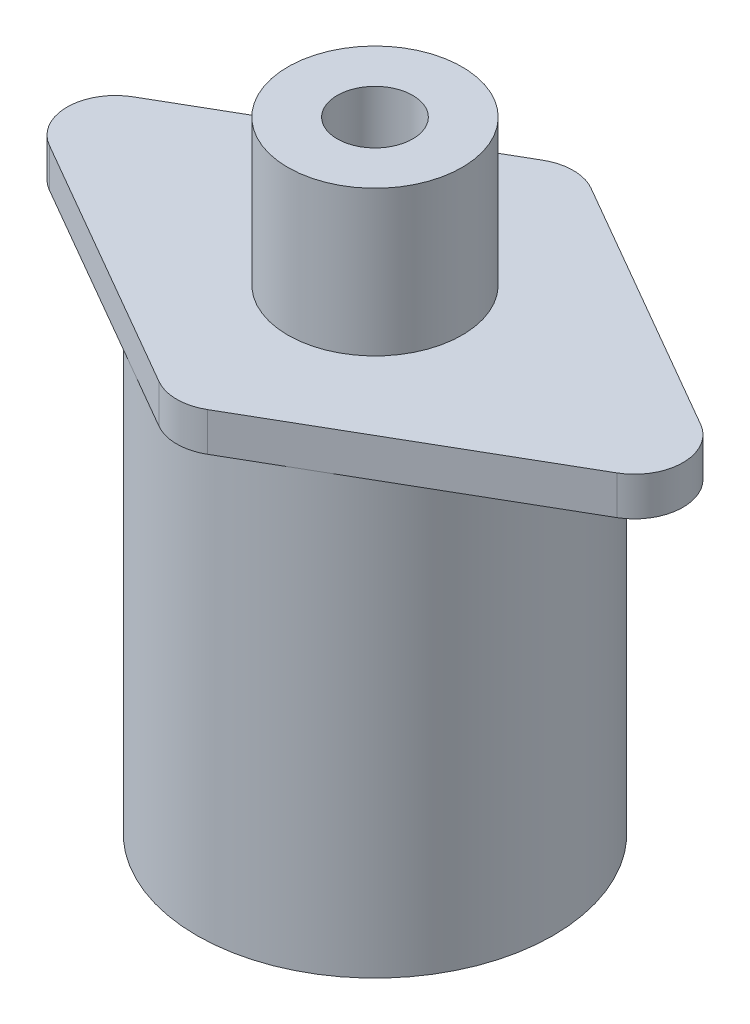
ISO-10303-21;
HEADER;
FILE_DESCRIPTION(('STEP AP214'),'2;1');
FILE_NAME('part.step','',(''),(''),'','','');
FILE_SCHEMA(('AUTOMOTIVE_DESIGN { 1 0 10303 214 1 1 1 1 }'));
ENDSEC;
DATA;
#1=APPLICATION_CONTEXT('core data for automotive mechanical design processes');
#2=APPLICATION_PROTOCOL_DEFINITION('international standard','automotive_design',2000,#1);
#3=PRODUCT_CONTEXT('',#1,'mechanical');
#4=PRODUCT('Part','Part','',(#3));
#5=PRODUCT_RELATED_PRODUCT_CATEGORY('part','',(#4));
#6=PRODUCT_DEFINITION_FORMATION('','',#4);
#7=PRODUCT_DEFINITION_CONTEXT('part definition',#1,'design');
#8=PRODUCT_DEFINITION('design','',#6,#7);
#9=PRODUCT_DEFINITION_SHAPE('','',#8);
#10=(LENGTH_UNIT() NAMED_UNIT(*) SI_UNIT(.MILLI.,.METRE.));
#11=(NAMED_UNIT(*) PLANE_ANGLE_UNIT() SI_UNIT($,.RADIAN.));
#12=(NAMED_UNIT(*) SI_UNIT($,.STERADIAN.) SOLID_ANGLE_UNIT());
#13=UNCERTAINTY_MEASURE_WITH_UNIT(LENGTH_MEASURE(1.E-05),#10,'distance_accuracy_value','');
#14=(GEOMETRIC_REPRESENTATION_CONTEXT(3) GLOBAL_UNCERTAINTY_ASSIGNED_CONTEXT((#13)) GLOBAL_UNIT_ASSIGNED_CONTEXT((#10,
#11,#12)) REPRESENTATION_CONTEXT('',''));
#15=CARTESIAN_POINT('',(0.,0.,0.));
#16=DIRECTION('',(0.,0.,1.));
#17=DIRECTION('',(1.,0.,0.));
#18=AXIS2_PLACEMENT_3D('',#15,#16,#17);
#19=CARTESIAN_POINT('',(0.,45.,0.));
#20=DIRECTION('',(0.,-1.,0.));
#21=DIRECTION('',(0.,0.,-1.));
#22=AXIS2_PLACEMENT_3D('',#19,#20,#21);
#23=CYLINDRICAL_SURFACE('',#22,18.4);
#24=CARTESIAN_POINT('',(0.,45.,0.));
#25=DIRECTION('',(0.,1.,0.));
#26=DIRECTION('',(0.,0.,1.));
#27=AXIS2_PLACEMENT_3D('',#24,#25,#26);
#28=CIRCLE('',#27,18.4);
#29=CARTESIAN_POINT('',(0.,45.,18.4));
#30=VERTEX_POINT('',#29);
#31=EDGE_CURVE('E148',#30,#30,#28,.T.);
#32=ORIENTED_EDGE('',*,*,#31,.F.);
#33=EDGE_LOOP('',(#32));
#34=FACE_BOUND('',#33,.T.);
#35=CARTESIAN_POINT('',(0.,0.,0.));
#36=DIRECTION('',(0.,1.,0.));
#37=DIRECTION('',(0.,0.,1.));
#38=AXIS2_PLACEMENT_3D('',#35,#36,#37);
#39=CIRCLE('',#38,18.4);
#40=CARTESIAN_POINT('',(0.,0.,18.4));
#41=VERTEX_POINT('',#40);
#42=EDGE_CURVE('E151',#41,#41,#39,.T.);
#43=ORIENTED_EDGE('',*,*,#42,.T.);
#44=EDGE_LOOP('',(#43));
#45=FACE_BOUND('',#44,.T.);
#46=ADVANCED_FACE('F42',(#34,#45),#23,.T.);
#47=CARTESIAN_POINT('',(0.,0.,0.));
#48=DIRECTION('',(0.,1.,0.));
#49=DIRECTION('',(0.,0.,1.));
#50=AXIS2_PLACEMENT_3D('',#47,#48,#49);
#51=PLANE('',#50);
#52=ORIENTED_EDGE('',*,*,#42,.F.);
#53=EDGE_LOOP('',(#52));
#54=FACE_BOUND('',#53,.T.);
#55=ADVANCED_FACE('F239',(#54),#51,.F.);
#56=CARTESIAN_POINT('',(36.8060796608387,49.,0.));
#57=DIRECTION('',(-0.5,0.,0.866025403784439));
#58=DIRECTION('',(0.866025403784439,0.,0.5));
#59=AXIS2_PLACEMENT_3D('',#56,#57,#58);
#60=PLANE('',#59);
#61=DIRECTION('',(-0.866025403784439,0.,-0.5));
#62=VECTOR('',#61,1.);
#63=CARTESIAN_POINT('',(36.8060796608387,45.,0.));
#64=LINE('',#63,#62);
#65=CARTESIAN_POINT('',(29.3060796608386,45.,-4.3301270189222));
#66=VERTEX_POINT('',#65);
#67=CARTESIAN_POINT('',(2.50000000000001,45.,-19.8066243270259));
#68=VERTEX_POINT('',#67);
#69=EDGE_CURVE('E137',#66,#68,#64,.T.);
#70=ORIENTED_EDGE('',*,*,#69,.T.);
#71=DIRECTION('',(0.,-1.,0.));
#72=VECTOR('',#71,1.);
#73=CARTESIAN_POINT('',(2.5,49.,-19.8066243270259));
#74=LINE('',#73,#72);
#75=CARTESIAN_POINT('',(2.50000000000001,49.,-19.8066243270259));
#76=VERTEX_POINT('',#75);
#77=EDGE_CURVE('E115',#68,#76,#74,.F.);
#78=ORIENTED_EDGE('',*,*,#77,.T.);
#79=DIRECTION('',(-0.866025403784439,0.,-0.5));
#80=VECTOR('',#79,1.);
#81=CARTESIAN_POINT('',(36.8060796608387,49.,0.));
#82=LINE('',#81,#80);
#83=CARTESIAN_POINT('',(29.3060796608386,49.,-4.3301270189222));
#84=VERTEX_POINT('',#83);
#85=EDGE_CURVE('E147',#84,#76,#82,.T.);
#86=ORIENTED_EDGE('',*,*,#85,.F.);
#87=DIRECTION('',(0.,-1.,0.));
#88=VECTOR('',#87,1.);
#89=CARTESIAN_POINT('',(29.3060796608386,49.,-4.3301270189222));
#90=LINE('',#89,#88);
#91=EDGE_CURVE('E120',#84,#66,#90,.T.);
#92=ORIENTED_EDGE('',*,*,#91,.T.);
#93=EDGE_LOOP('',(#70,#78,#86,#92));
#94=FACE_BOUND('',#93,.T.);
#95=ADVANCED_FACE('F196',(#94),#60,.F.);
#96=CARTESIAN_POINT('',(0.,49.,-21.25));
#97=DIRECTION('',(0.5,0.,0.866025403784439));
#98=DIRECTION('',(0.866025403784439,0.,-0.5));
#99=AXIS2_PLACEMENT_3D('',#96,#97,#98);
#100=PLANE('',#99);
#101=DIRECTION('',(-0.866025403784439,0.,0.5));
#102=VECTOR('',#101,1.);
#103=CARTESIAN_POINT('',(0.,49.,-21.25));
#104=LINE('',#103,#102);
#105=CARTESIAN_POINT('',(-2.5,49.,-19.8066243270259));
#106=VERTEX_POINT('',#105);
#107=CARTESIAN_POINT('',(-29.3060796608386,49.,-4.3301270189222));
#108=VERTEX_POINT('',#107);
#109=EDGE_CURVE('E130',#106,#108,#104,.T.);
#110=ORIENTED_EDGE('',*,*,#109,.F.);
#111=DIRECTION('',(0.,-1.,0.));
#112=VECTOR('',#111,1.);
#113=CARTESIAN_POINT('',(-2.5,49.,-19.8066243270259));
#114=LINE('',#113,#112);
#115=CARTESIAN_POINT('',(-2.5,45.,-19.8066243270259));
#116=VERTEX_POINT('',#115);
#117=EDGE_CURVE('E114',#106,#116,#114,.T.);
#118=ORIENTED_EDGE('',*,*,#117,.T.);
#119=DIRECTION('',(-0.866025403784439,0.,0.5));
#120=VECTOR('',#119,1.);
#121=CARTESIAN_POINT('',(0.,45.,-21.25));
#122=LINE('',#121,#120);
#123=CARTESIAN_POINT('',(-29.3060796608386,45.,-4.3301270189222));
#124=VERTEX_POINT('',#123);
#125=EDGE_CURVE('E127',#116,#124,#122,.T.);
#126=ORIENTED_EDGE('',*,*,#125,.T.);
#127=DIRECTION('',(0.,-1.,0.));
#128=VECTOR('',#127,1.);
#129=CARTESIAN_POINT('',(-29.3060796608386,49.,-4.3301270189222));
#130=LINE('',#129,#128);
#131=EDGE_CURVE('E132',#124,#108,#130,.F.);
#132=ORIENTED_EDGE('',*,*,#131,.T.);
#133=EDGE_LOOP('',(#110,#118,#126,#132));
#134=FACE_BOUND('',#133,.T.);
#135=ADVANCED_FACE('F126',(#134),#100,.F.);
#136=CARTESIAN_POINT('',(-36.8060796608386,49.,0.));
#137=DIRECTION('',(0.5,0.,-0.866025403784439));
#138=DIRECTION('',(-0.866025403784439,0.,-0.5));
#139=AXIS2_PLACEMENT_3D('',#136,#137,#138);
#140=PLANE('',#139);
#141=DIRECTION('',(0.866025403784439,0.,0.5));
#142=VECTOR('',#141,1.);
#143=CARTESIAN_POINT('',(-36.8060796608386,45.,0.));
#144=LINE('',#143,#142);
#145=CARTESIAN_POINT('',(-29.3060796608386,45.,4.33012701892218));
#146=VERTEX_POINT('',#145);
#147=CARTESIAN_POINT('',(-2.5,45.,19.8066243270259));
#148=VERTEX_POINT('',#147);
#149=EDGE_CURVE('E136',#146,#148,#144,.T.);
#150=ORIENTED_EDGE('',*,*,#149,.T.);
#151=DIRECTION('',(0.,-1.,0.));
#152=VECTOR('',#151,1.);
#153=CARTESIAN_POINT('',(-2.5,49.,19.8066243270259));
#154=LINE('',#153,#152);
#155=CARTESIAN_POINT('',(-2.5,49.,19.8066243270259));
#156=VERTEX_POINT('',#155);
#157=EDGE_CURVE('E46',#148,#156,#154,.F.);
#158=ORIENTED_EDGE('',*,*,#157,.T.);
#159=DIRECTION('',(0.866025403784439,0.,0.5));
#160=VECTOR('',#159,1.);
#161=CARTESIAN_POINT('',(-36.8060796608386,49.,0.));
#162=LINE('',#161,#160);
#163=CARTESIAN_POINT('',(-29.3060796608386,49.,4.33012701892218));
#164=VERTEX_POINT('',#163);
#165=EDGE_CURVE('E180',#164,#156,#162,.T.);
#166=ORIENTED_EDGE('',*,*,#165,.F.);
#167=DIRECTION('',(0.,-1.,0.));
#168=VECTOR('',#167,1.);
#169=CARTESIAN_POINT('',(-29.3060796608386,49.,4.33012701892218));
#170=LINE('',#169,#168);
#171=EDGE_CURVE('E173',#164,#146,#170,.T.);
#172=ORIENTED_EDGE('',*,*,#171,.T.);
#173=EDGE_LOOP('',(#150,#158,#166,#172));
#174=FACE_BOUND('',#173,.T.);
#175=ADVANCED_FACE('F179',(#174),#140,.F.);
#176=CARTESIAN_POINT('',(0.,49.,21.25));
#177=DIRECTION('',(-0.5,0.,-0.866025403784439));
#178=DIRECTION('',(-0.866025403784439,0.,0.5));
#179=AXIS2_PLACEMENT_3D('',#176,#177,#178);
#180=PLANE('',#179);
#181=DIRECTION('',(0.866025403784439,0.,-0.5));
#182=VECTOR('',#181,1.);
#183=CARTESIAN_POINT('',(0.,49.,21.25));
#184=LINE('',#183,#182);
#185=CARTESIAN_POINT('',(2.5,49.,19.8066243270259));
#186=VERTEX_POINT('',#185);
#187=CARTESIAN_POINT('',(29.3060796608386,49.,4.33012701892219));
#188=VERTEX_POINT('',#187);
#189=EDGE_CURVE('E154',#186,#188,#184,.T.);
#190=ORIENTED_EDGE('',*,*,#189,.F.);
#191=DIRECTION('',(0.,-1.,0.));
#192=VECTOR('',#191,1.);
#193=CARTESIAN_POINT('',(2.5,49.,19.8066243270259));
#194=LINE('',#193,#192);
#195=CARTESIAN_POINT('',(2.5,45.,19.8066243270259));
#196=VERTEX_POINT('',#195);
#197=EDGE_CURVE('E171',#186,#196,#194,.T.);
#198=ORIENTED_EDGE('',*,*,#197,.T.);
#199=DIRECTION('',(0.866025403784439,0.,-0.5));
#200=VECTOR('',#199,1.);
#201=CARTESIAN_POINT('',(0.,45.,21.25));
#202=LINE('',#201,#200);
#203=CARTESIAN_POINT('',(29.3060796608386,45.,4.33012701892219));
#204=VERTEX_POINT('',#203);
#205=EDGE_CURVE('E140',#196,#204,#202,.T.);
#206=ORIENTED_EDGE('',*,*,#205,.T.);
#207=DIRECTION('',(0.,-1.,0.));
#208=VECTOR('',#207,1.);
#209=CARTESIAN_POINT('',(29.3060796608386,49.,4.33012701892219));
#210=LINE('',#209,#208);
#211=EDGE_CURVE('E58',#204,#188,#210,.F.);
#212=ORIENTED_EDGE('',*,*,#211,.T.);
#213=EDGE_LOOP('',(#190,#198,#206,#212));
#214=FACE_BOUND('',#213,.T.);
#215=ADVANCED_FACE('F189',(#214),#180,.F.);
#216=CARTESIAN_POINT('',(0.,49.,0.));
#217=DIRECTION('',(0.,1.,0.));
#218=DIRECTION('',(0.,0.,1.));
#219=AXIS2_PLACEMENT_3D('',#216,#217,#218);
#220=PLANE('',#219);
#221=CARTESIAN_POINT('',(0.,49.,0.));
#222=DIRECTION('',(0.,1.,0.));
#223=DIRECTION('',(0.,0.,1.));
#224=AXIS2_PLACEMENT_3D('',#221,#222,#223);
#225=CIRCLE('',#224,9.);
#226=CARTESIAN_POINT('',(0.,49.,9.));
#227=VERTEX_POINT('',#226);
#228=EDGE_CURVE('E11',#227,#227,#225,.T.);
#229=ORIENTED_EDGE('',*,*,#228,.F.);
#230=EDGE_LOOP('',(#229));
#231=FACE_BOUND('',#230,.T.);
#232=ORIENTED_EDGE('',*,*,#85,.T.);
#233=CARTESIAN_POINT('',(0.,49.,-15.4764973081037));
#234=DIRECTION('',(0.,1.,0.));
#235=DIRECTION('',(0.,0.,1.));
#236=AXIS2_PLACEMENT_3D('',#233,#234,#235);
#237=CIRCLE('',#236,5.);
#238=EDGE_CURVE('E168',#76,#106,#237,.T.);
#239=ORIENTED_EDGE('',*,*,#238,.T.);
#240=ORIENTED_EDGE('',*,*,#109,.T.);
#241=CARTESIAN_POINT('',(-26.8060796608386,49.,0.));
#242=DIRECTION('',(0.,1.,0.));
#243=DIRECTION('',(0.,0.,1.));
#244=AXIS2_PLACEMENT_3D('',#241,#242,#243);
#245=CIRCLE('',#244,5.);
#246=EDGE_CURVE('E163',#108,#164,#245,.T.);
#247=ORIENTED_EDGE('',*,*,#246,.T.);
#248=ORIENTED_EDGE('',*,*,#165,.T.);
#249=CARTESIAN_POINT('',(0.,49.,15.4764973081037));
#250=DIRECTION('',(0.,1.,0.));
#251=DIRECTION('',(0.,0.,1.));
#252=AXIS2_PLACEMENT_3D('',#249,#250,#251);
#253=CIRCLE('',#252,5.);
#254=EDGE_CURVE('E65',#156,#186,#253,.T.);
#255=ORIENTED_EDGE('',*,*,#254,.T.);
#256=ORIENTED_EDGE('',*,*,#189,.T.);
#257=CARTESIAN_POINT('',(26.8060796608386,49.,0.));
#258=DIRECTION('',(0.,1.,0.));
#259=DIRECTION('',(0.,0.,1.));
#260=AXIS2_PLACEMENT_3D('',#257,#258,#259);
#261=CIRCLE('',#260,5.);
#262=EDGE_CURVE('E165',#188,#84,#261,.T.);
#263=ORIENTED_EDGE('',*,*,#262,.T.);
#264=EDGE_LOOP('',(#232,#239,#240,#247,#248,#255,#256,#263));
#265=FACE_BOUND('',#264,.T.);
#266=ADVANCED_FACE('F183',(#231,#265),#220,.T.);
#267=CARTESIAN_POINT('',(0.,45.,0.));
#268=DIRECTION('',(0.,1.,0.));
#269=DIRECTION('',(0.,0.,1.));
#270=AXIS2_PLACEMENT_3D('',#267,#268,#269);
#271=PLANE('',#270);
#272=ORIENTED_EDGE('',*,*,#31,.T.);
#273=EDGE_LOOP('',(#272));
#274=FACE_BOUND('',#273,.T.);
#275=ORIENTED_EDGE('',*,*,#125,.F.);
#276=CARTESIAN_POINT('',(0.,45.,-15.4764973081037));
#277=DIRECTION('',(0.,1.,0.));
#278=DIRECTION('',(0.,0.,1.));
#279=AXIS2_PLACEMENT_3D('',#276,#277,#278);
#280=CIRCLE('',#279,5.);
#281=EDGE_CURVE('E110',#116,#68,#280,.F.);
#282=ORIENTED_EDGE('',*,*,#281,.T.);
#283=ORIENTED_EDGE('',*,*,#69,.F.);
#284=CARTESIAN_POINT('',(26.8060796608386,45.,0.));
#285=DIRECTION('',(0.,1.,0.));
#286=DIRECTION('',(0.,0.,1.));
#287=AXIS2_PLACEMENT_3D('',#284,#285,#286);
#288=CIRCLE('',#287,5.);
#289=EDGE_CURVE('E157',#66,#204,#288,.F.);
#290=ORIENTED_EDGE('',*,*,#289,.T.);
#291=ORIENTED_EDGE('',*,*,#205,.F.);
#292=CARTESIAN_POINT('',(0.,45.,15.4764973081037));
#293=DIRECTION('',(0.,1.,0.));
#294=DIRECTION('',(0.,0.,1.));
#295=AXIS2_PLACEMENT_3D('',#292,#293,#294);
#296=CIRCLE('',#295,5.);
#297=EDGE_CURVE('E121',#196,#148,#296,.F.);
#298=ORIENTED_EDGE('',*,*,#297,.T.);
#299=ORIENTED_EDGE('',*,*,#149,.F.);
#300=CARTESIAN_POINT('',(-26.8060796608386,45.,0.));
#301=DIRECTION('',(0.,1.,0.));
#302=DIRECTION('',(0.,0.,1.));
#303=AXIS2_PLACEMENT_3D('',#300,#301,#302);
#304=CIRCLE('',#303,5.);
#305=EDGE_CURVE('E131',#146,#124,#304,.F.);
#306=ORIENTED_EDGE('',*,*,#305,.T.);
#307=EDGE_LOOP('',(#275,#282,#283,#290,#291,#298,#299,#306));
#308=FACE_BOUND('',#307,.T.);
#309=ADVANCED_FACE('F134',(#274,#308),#271,.F.);
#310=CARTESIAN_POINT('',(0.,49.,-15.4764973081037));
#311=DIRECTION('',(0.,-1.,0.));
#312=DIRECTION('',(0.,0.,-1.));
#313=AXIS2_PLACEMENT_3D('',#310,#311,#312);
#314=CYLINDRICAL_SURFACE('',#313,5.);
#315=ORIENTED_EDGE('',*,*,#238,.F.);
#316=ORIENTED_EDGE('',*,*,#77,.F.);
#317=ORIENTED_EDGE('',*,*,#281,.F.);
#318=ORIENTED_EDGE('',*,*,#117,.F.);
#319=EDGE_LOOP('',(#315,#316,#317,#318));
#320=FACE_BOUND('',#319,.T.);
#321=ADVANCED_FACE('F113',(#320),#314,.T.);
#322=CARTESIAN_POINT('',(0.,49.,15.4764973081037));
#323=DIRECTION('',(0.,-1.,0.));
#324=DIRECTION('',(0.,0.,-1.));
#325=AXIS2_PLACEMENT_3D('',#322,#323,#324);
#326=CYLINDRICAL_SURFACE('',#325,5.);
#327=ORIENTED_EDGE('',*,*,#254,.F.);
#328=ORIENTED_EDGE('',*,*,#157,.F.);
#329=ORIENTED_EDGE('',*,*,#297,.F.);
#330=ORIENTED_EDGE('',*,*,#197,.F.);
#331=EDGE_LOOP('',(#327,#328,#329,#330));
#332=FACE_BOUND('',#331,.T.);
#333=ADVANCED_FACE('F187',(#332),#326,.T.);
#334=CARTESIAN_POINT('',(26.8060796608386,49.,0.));
#335=DIRECTION('',(0.,-1.,0.));
#336=DIRECTION('',(0.,0.,-1.));
#337=AXIS2_PLACEMENT_3D('',#334,#335,#336);
#338=CYLINDRICAL_SURFACE('',#337,5.);
#339=ORIENTED_EDGE('',*,*,#262,.F.);
#340=ORIENTED_EDGE('',*,*,#211,.F.);
#341=ORIENTED_EDGE('',*,*,#289,.F.);
#342=ORIENTED_EDGE('',*,*,#91,.F.);
#343=EDGE_LOOP('',(#339,#340,#341,#342));
#344=FACE_BOUND('',#343,.T.);
#345=ADVANCED_FACE('F193',(#344),#338,.T.);
#346=CARTESIAN_POINT('',(-26.8060796608386,49.,0.));
#347=DIRECTION('',(0.,-1.,0.));
#348=DIRECTION('',(0.,0.,-1.));
#349=AXIS2_PLACEMENT_3D('',#346,#347,#348);
#350=CYLINDRICAL_SURFACE('',#349,5.);
#351=ORIENTED_EDGE('',*,*,#246,.F.);
#352=ORIENTED_EDGE('',*,*,#131,.F.);
#353=ORIENTED_EDGE('',*,*,#305,.F.);
#354=ORIENTED_EDGE('',*,*,#171,.F.);
#355=EDGE_LOOP('',(#351,#352,#353,#354));
#356=FACE_BOUND('',#355,.T.);
#357=ADVANCED_FACE('F44',(#356),#350,.T.);
#358=CARTESIAN_POINT('',(0.,64.,0.));
#359=DIRECTION('',(0.,-1.,0.));
#360=DIRECTION('',(0.,0.,-1.));
#361=AXIS2_PLACEMENT_3D('',#358,#359,#360);
#362=CYLINDRICAL_SURFACE('',#361,9.);
#363=CARTESIAN_POINT('',(0.,64.,0.));
#364=DIRECTION('',(0.,1.,0.));
#365=DIRECTION('',(0.,0.,1.));
#366=AXIS2_PLACEMENT_3D('',#363,#364,#365);
#367=CIRCLE('',#366,9.);
#368=CARTESIAN_POINT('',(0.,64.,9.));
#369=VERTEX_POINT('',#368);
#370=EDGE_CURVE('E142',#369,#369,#367,.T.);
#371=ORIENTED_EDGE('',*,*,#370,.F.);
#372=EDGE_LOOP('',(#371));
#373=FACE_BOUND('',#372,.T.);
#374=ORIENTED_EDGE('',*,*,#228,.T.);
#375=EDGE_LOOP('',(#374));
#376=FACE_BOUND('',#375,.T.);
#377=ADVANCED_FACE('F220',(#373,#376),#362,.T.);
#378=CARTESIAN_POINT('',(0.,64.,0.));
#379=DIRECTION('',(0.,1.,0.));
#380=DIRECTION('',(0.,0.,1.));
#381=AXIS2_PLACEMENT_3D('',#378,#379,#380);
#382=PLANE('',#381);
#383=CARTESIAN_POINT('',(0.,64.,0.));
#384=DIRECTION('',(0.,1.,0.));
#385=DIRECTION('',(0.,0.,1.));
#386=AXIS2_PLACEMENT_3D('',#383,#384,#385);
#387=CIRCLE('',#386,3.9);
#388=CARTESIAN_POINT('',(0.,64.,3.9));
#389=VERTEX_POINT('',#388);
#390=EDGE_CURVE('E203',#389,#389,#387,.T.);
#391=ORIENTED_EDGE('',*,*,#390,.F.);
#392=EDGE_LOOP('',(#391));
#393=FACE_BOUND('',#392,.T.);
#394=ORIENTED_EDGE('',*,*,#370,.T.);
#395=EDGE_LOOP('',(#394));
#396=FACE_BOUND('',#395,.T.);
#397=ADVANCED_FACE('F214',(#393,#396),#382,.T.);
#398=CARTESIAN_POINT('',(0.,54.,0.));
#399=DIRECTION('',(0.,1.,0.));
#400=DIRECTION('',(0.,0.,1.));
#401=AXIS2_PLACEMENT_3D('',#398,#399,#400);
#402=CYLINDRICAL_SURFACE('',#401,3.9);
#403=CARTESIAN_POINT('',(0.,54.,0.));
#404=DIRECTION('',(0.,1.,0.));
#405=DIRECTION('',(0.,0.,1.));
#406=AXIS2_PLACEMENT_3D('',#403,#404,#405);
#407=CIRCLE('',#406,3.9);
#408=CARTESIAN_POINT('',(0.,54.,3.9));
#409=VERTEX_POINT('',#408);
#410=EDGE_CURVE('E202',#409,#409,#407,.T.);
#411=ORIENTED_EDGE('',*,*,#410,.F.);
#412=EDGE_LOOP('',(#411));
#413=FACE_BOUND('',#412,.T.);
#414=ORIENTED_EDGE('',*,*,#390,.T.);
#415=EDGE_LOOP('',(#414));
#416=FACE_BOUND('',#415,.T.);
#417=ADVANCED_FACE('F211',(#413,#416),#402,.F.);
#418=CARTESIAN_POINT('',(0.,54.,0.));
#419=DIRECTION('',(0.,1.,0.));
#420=DIRECTION('',(0.,0.,1.));
#421=AXIS2_PLACEMENT_3D('',#418,#419,#420);
#422=PLANE('',#421);
#423=ORIENTED_EDGE('',*,*,#410,.T.);
#424=EDGE_LOOP('',(#423));
#425=FACE_BOUND('',#424,.T.);
#426=ADVANCED_FACE('F209',(#425),#422,.T.);
#427=CLOSED_SHELL('',(#46,#55,#95,#135,#175,#215,#266,#309,#321,#333,#345,#357,#377,#397,#417,#426));
#428=MANIFOLD_SOLID_BREP('B2',#427);
#429=ADVANCED_BREP_SHAPE_REPRESENTATION('',(#18,#428),#14);
#430=SHAPE_DEFINITION_REPRESENTATION(#9,#429);
ENDSEC;
END-ISO-10303-21;
